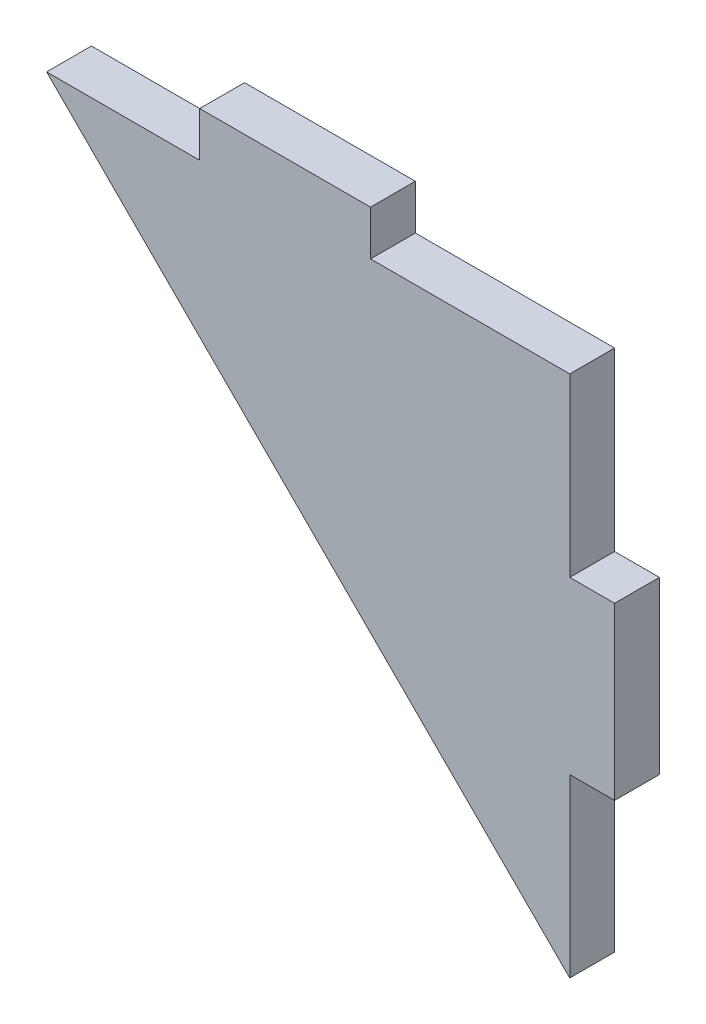
ISO-10303-21;
HEADER;
FILE_DESCRIPTION(('STEP AP214'),'2;1');
FILE_NAME('part.step','',(''),(''),'','','');
FILE_SCHEMA(('AUTOMOTIVE_DESIGN { 1 0 10303 214 1 1 1 1 }'));
ENDSEC;
DATA;
#1=APPLICATION_CONTEXT('core data for automotive mechanical design processes');
#2=APPLICATION_PROTOCOL_DEFINITION('international standard','automotive_design',2000,#1);
#3=PRODUCT_CONTEXT('',#1,'mechanical');
#4=PRODUCT('Part','Part','',(#3));
#5=PRODUCT_RELATED_PRODUCT_CATEGORY('part','',(#4));
#6=PRODUCT_DEFINITION_FORMATION('','',#4);
#7=PRODUCT_DEFINITION_CONTEXT('part definition',#1,'design');
#8=PRODUCT_DEFINITION('design','',#6,#7);
#9=PRODUCT_DEFINITION_SHAPE('','',#8);
#10=(LENGTH_UNIT() NAMED_UNIT(*) SI_UNIT(.MILLI.,.METRE.));
#11=(NAMED_UNIT(*) PLANE_ANGLE_UNIT() SI_UNIT($,.RADIAN.));
#12=(NAMED_UNIT(*) SI_UNIT($,.STERADIAN.) SOLID_ANGLE_UNIT());
#13=UNCERTAINTY_MEASURE_WITH_UNIT(LENGTH_MEASURE(1.E-05),#10,'distance_accuracy_value','');
#14=(GEOMETRIC_REPRESENTATION_CONTEXT(3) GLOBAL_UNCERTAINTY_ASSIGNED_CONTEXT((#13)) GLOBAL_UNIT_ASSIGNED_CONTEXT((#10,
#11,#12)) REPRESENTATION_CONTEXT('',''));
#15=CARTESIAN_POINT('',(0.,0.,0.));
#16=DIRECTION('',(0.,0.,1.));
#17=DIRECTION('',(1.,0.,0.));
#18=AXIS2_PLACEMENT_3D('',#15,#16,#17);
#19=CARTESIAN_POINT('',(0.,0.,0.));
#20=DIRECTION('',(0.,0.,1.));
#21=DIRECTION('',(1.,0.,0.));
#22=AXIS2_PLACEMENT_3D('',#19,#20,#21);
#23=PLANE('',#22);
#24=DIRECTION('',(-1.,0.,0.));
#25=VECTOR('',#24,1.);
#26=CARTESIAN_POINT('',(2.69625591694681E-13,215.9,0.));
#27=LINE('',#26,#25);
#28=CARTESIAN_POINT('',(53.975,215.9,0.));
#29=VERTEX_POINT('',#28);
#30=CARTESIAN_POINT('',(76.2,215.9,0.));
#31=VERTEX_POINT('',#30);
#32=EDGE_CURVE('E142',#29,#31,#27,.F.);
#33=ORIENTED_EDGE('',*,*,#32,.F.);
#34=DIRECTION('',(0.,1.,0.));
#35=VECTOR('',#34,1.);
#36=CARTESIAN_POINT('',(53.975,0.,0.));
#37=LINE('',#36,#35);
#38=CARTESIAN_POINT('',(53.975,220.9,0.));
#39=VERTEX_POINT('',#38);
#40=EDGE_CURVE('E146',#39,#29,#37,.F.);
#41=ORIENTED_EDGE('',*,*,#40,.F.);
#42=DIRECTION('',(1.,0.,0.));
#43=VECTOR('',#42,1.);
#44=CARTESIAN_POINT('',(34.925,220.9,0.));
#45=LINE('',#44,#43);
#46=CARTESIAN_POINT('',(34.925,220.9,0.));
#47=VERTEX_POINT('',#46);
#48=EDGE_CURVE('E153',#39,#47,#45,.F.);
#49=ORIENTED_EDGE('',*,*,#48,.T.);
#50=DIRECTION('',(0.,1.,0.));
#51=VECTOR('',#50,1.);
#52=CARTESIAN_POINT('',(34.925,0.,0.));
#53=LINE('',#52,#51);
#54=CARTESIAN_POINT('',(34.925,215.9,0.));
#55=VERTEX_POINT('',#54);
#56=EDGE_CURVE('E105',#47,#55,#53,.F.);
#57=ORIENTED_EDGE('',*,*,#56,.T.);
#58=DIRECTION('',(1.,0.,0.));
#59=VECTOR('',#58,1.);
#60=CARTESIAN_POINT('',(0.,215.9,0.));
#61=LINE('',#60,#59);
#62=CARTESIAN_POINT('',(17.8437431325959,215.9,0.));
#63=VERTEX_POINT('',#62);
#64=EDGE_CURVE('E19',#63,#55,#61,.T.);
#65=ORIENTED_EDGE('',*,*,#64,.F.);
#66=DIRECTION('',(-0.707106781186551,0.707106781186544,0.));
#67=VECTOR('',#66,1.);
#68=CARTESIAN_POINT('',(116.871871566298,116.871871566299,0.));
#69=LINE('',#68,#67);
#70=CARTESIAN_POINT('',(76.2000000000001,157.543743132596,0.));
#71=VERTEX_POINT('',#70);
#72=EDGE_CURVE('E103',#63,#71,#69,.F.);
#73=ORIENTED_EDGE('',*,*,#72,.T.);
#74=DIRECTION('',(0.,1.,0.));
#75=VECTOR('',#74,1.);
#76=CARTESIAN_POINT('',(76.2,0.,0.));
#77=LINE('',#76,#75);
#78=CARTESIAN_POINT('',(76.2,177.195,0.));
#79=VERTEX_POINT('',#78);
#80=EDGE_CURVE('E96',#79,#71,#77,.F.);
#81=ORIENTED_EDGE('',*,*,#80,.F.);
#82=DIRECTION('',(-1.,0.,0.));
#83=VECTOR('',#82,1.);
#84=CARTESIAN_POINT('',(81.2,177.195,0.));
#85=LINE('',#84,#83);
#86=CARTESIAN_POINT('',(81.2,177.195,0.));
#87=VERTEX_POINT('',#86);
#88=EDGE_CURVE('E123',#79,#87,#85,.F.);
#89=ORIENTED_EDGE('',*,*,#88,.T.);
#90=DIRECTION('',(0.,-1.,0.));
#91=VECTOR('',#90,1.);
#92=CARTESIAN_POINT('',(81.2000000000001,0.,0.));
#93=LINE('',#92,#91);
#94=CARTESIAN_POINT('',(81.2,196.245,0.));
#95=VERTEX_POINT('',#94);
#96=EDGE_CURVE('E130',#87,#95,#93,.F.);
#97=ORIENTED_EDGE('',*,*,#96,.T.);
#98=DIRECTION('',(1.,0.,0.));
#99=VECTOR('',#98,1.);
#100=CARTESIAN_POINT('',(81.2,196.245,0.));
#101=LINE('',#100,#99);
#102=CARTESIAN_POINT('',(76.2,196.245,0.));
#103=VERTEX_POINT('',#102);
#104=EDGE_CURVE('E135',#95,#103,#101,.F.);
#105=ORIENTED_EDGE('',*,*,#104,.T.);
#106=DIRECTION('',(0.,1.,0.));
#107=VECTOR('',#106,1.);
#108=CARTESIAN_POINT('',(76.2,0.,0.));
#109=LINE('',#108,#107);
#110=EDGE_CURVE('E139',#31,#103,#109,.F.);
#111=ORIENTED_EDGE('',*,*,#110,.F.);
#112=EDGE_LOOP('',(#33,#41,#49,#57,#65,#73,#81,#89,#97,#105,#111));
#113=FACE_BOUND('',#112,.T.);
#114=ADVANCED_FACE('F16',(#113),#23,.T.);
#115=CARTESIAN_POINT('',(0.,215.9,-5.));
#116=DIRECTION('',(0.,1.,0.));
#117=DIRECTION('',(0.,0.,1.));
#118=AXIS2_PLACEMENT_3D('',#115,#116,#117);
#119=PLANE('',#118);
#120=DIRECTION('',(0.,0.,-1.));
#121=VECTOR('',#120,1.);
#122=CARTESIAN_POINT('',(34.925,215.9,-5.));
#123=LINE('',#122,#121);
#124=CARTESIAN_POINT('',(34.925,215.9,-5.));
#125=VERTEX_POINT('',#124);
#126=EDGE_CURVE('E155',#55,#125,#123,.T.);
#127=ORIENTED_EDGE('',*,*,#126,.T.);
#128=DIRECTION('',(1.,0.,0.));
#129=VECTOR('',#128,1.);
#130=CARTESIAN_POINT('',(0.,215.9,-5.));
#131=LINE('',#130,#129);
#132=CARTESIAN_POINT('',(17.8437431325959,215.9,-5.));
#133=VERTEX_POINT('',#132);
#134=EDGE_CURVE('E119',#125,#133,#131,.F.);
#135=ORIENTED_EDGE('',*,*,#134,.T.);
#136=DIRECTION('',(0.,0.,1.));
#137=VECTOR('',#136,1.);
#138=CARTESIAN_POINT('',(17.8437431325959,215.9,0.));
#139=LINE('',#138,#137);
#140=EDGE_CURVE('E110',#133,#63,#139,.T.);
#141=ORIENTED_EDGE('',*,*,#140,.T.);
#142=ORIENTED_EDGE('',*,*,#64,.T.);
#143=EDGE_LOOP('',(#127,#135,#141,#142));
#144=FACE_BOUND('',#143,.T.);
#145=ADVANCED_FACE('F118',(#144),#119,.T.);
#146=CARTESIAN_POINT('',(116.871871566298,116.871871566299,0.));
#147=DIRECTION('',(0.707106781186544,0.707106781186551,0.));
#148=DIRECTION('',(-0.707106781186551,0.707106781186544,0.));
#149=AXIS2_PLACEMENT_3D('',#146,#147,#148);
#150=PLANE('',#149);
#151=DIRECTION('',(0.,0.,1.));
#152=VECTOR('',#151,1.);
#153=CARTESIAN_POINT('',(76.2,157.543743132596,-5.));
#154=LINE('',#153,#152);
#155=CARTESIAN_POINT('',(76.2000000000001,157.543743132596,-5.));
#156=VERTEX_POINT('',#155);
#157=EDGE_CURVE('E115',#71,#156,#154,.F.);
#158=ORIENTED_EDGE('',*,*,#157,.F.);
#159=ORIENTED_EDGE('',*,*,#72,.F.);
#160=ORIENTED_EDGE('',*,*,#140,.F.);
#161=DIRECTION('',(0.707106781186547,-0.707106781186549,0.));
#162=VECTOR('',#161,1.);
#163=CARTESIAN_POINT('',(17.843743132596,215.9,-5.));
#164=LINE('',#163,#162);
#165=EDGE_CURVE('E160',#133,#156,#164,.T.);
#166=ORIENTED_EDGE('',*,*,#165,.T.);
#167=EDGE_LOOP('',(#158,#159,#160,#166));
#168=FACE_BOUND('',#167,.T.);
#169=ADVANCED_FACE('F112',(#168),#150,.F.);
#170=CARTESIAN_POINT('',(76.2,0.,-5.));
#171=DIRECTION('',(1.,0.,0.));
#172=DIRECTION('',(0.,1.,0.));
#173=AXIS2_PLACEMENT_3D('',#170,#171,#172);
#174=PLANE('',#173);
#175=ORIENTED_EDGE('',*,*,#157,.T.);
#176=DIRECTION('',(0.,1.,0.));
#177=VECTOR('',#176,1.);
#178=CARTESIAN_POINT('',(76.2,0.,-5.));
#179=LINE('',#178,#177);
#180=CARTESIAN_POINT('',(76.2,177.195,-5.));
#181=VERTEX_POINT('',#180);
#182=EDGE_CURVE('E162',#156,#181,#179,.T.);
#183=ORIENTED_EDGE('',*,*,#182,.T.);
#184=DIRECTION('',(0.,0.,1.));
#185=VECTOR('',#184,1.);
#186=CARTESIAN_POINT('',(76.2,177.195,0.));
#187=LINE('',#186,#185);
#188=EDGE_CURVE('E125',#181,#79,#187,.T.);
#189=ORIENTED_EDGE('',*,*,#188,.T.);
#190=ORIENTED_EDGE('',*,*,#80,.T.);
#191=EDGE_LOOP('',(#175,#183,#189,#190));
#192=FACE_BOUND('',#191,.T.);
#193=ADVANCED_FACE('F215',(#192),#174,.T.);
#194=CARTESIAN_POINT('',(81.2,177.195,0.));
#195=DIRECTION('',(0.,1.,0.));
#196=DIRECTION('',(-1.,0.,0.));
#197=AXIS2_PLACEMENT_3D('',#194,#195,#196);
#198=PLANE('',#197);
#199=DIRECTION('',(1.,0.,0.));
#200=VECTOR('',#199,1.);
#201=CARTESIAN_POINT('',(0.,177.195,-5.));
#202=LINE('',#201,#200);
#203=CARTESIAN_POINT('',(81.2,177.195,-5.));
#204=VERTEX_POINT('',#203);
#205=EDGE_CURVE('E165',#181,#204,#202,.T.);
#206=ORIENTED_EDGE('',*,*,#205,.T.);
#207=DIRECTION('',(0.,0.,1.));
#208=VECTOR('',#207,1.);
#209=CARTESIAN_POINT('',(81.2,177.195,0.));
#210=LINE('',#209,#208);
#211=EDGE_CURVE('E127',#204,#87,#210,.T.);
#212=ORIENTED_EDGE('',*,*,#211,.T.);
#213=ORIENTED_EDGE('',*,*,#88,.F.);
#214=ORIENTED_EDGE('',*,*,#188,.F.);
#215=EDGE_LOOP('',(#206,#212,#213,#214));
#216=FACE_BOUND('',#215,.T.);
#217=ADVANCED_FACE('F213',(#216),#198,.F.);
#218=CARTESIAN_POINT('',(81.2000000000001,0.,0.));
#219=DIRECTION('',(-1.,0.,0.));
#220=DIRECTION('',(0.,-1.,0.));
#221=AXIS2_PLACEMENT_3D('',#218,#219,#220);
#222=PLANE('',#221);
#223=DIRECTION('',(0.,0.,1.));
#224=VECTOR('',#223,1.);
#225=CARTESIAN_POINT('',(81.2,196.245,0.));
#226=LINE('',#225,#224);
#227=CARTESIAN_POINT('',(81.2,196.245,-5.));
#228=VERTEX_POINT('',#227);
#229=EDGE_CURVE('E132',#228,#95,#226,.T.);
#230=ORIENTED_EDGE('',*,*,#229,.T.);
#231=ORIENTED_EDGE('',*,*,#96,.F.);
#232=ORIENTED_EDGE('',*,*,#211,.F.);
#233=DIRECTION('',(0.,1.,0.));
#234=VECTOR('',#233,1.);
#235=CARTESIAN_POINT('',(81.2,0.,-5.));
#236=LINE('',#235,#234);
#237=EDGE_CURVE('E168',#204,#228,#236,.T.);
#238=ORIENTED_EDGE('',*,*,#237,.T.);
#239=EDGE_LOOP('',(#230,#231,#232,#238));
#240=FACE_BOUND('',#239,.T.);
#241=ADVANCED_FACE('F210',(#240),#222,.F.);
#242=CARTESIAN_POINT('',(81.2,196.245,0.));
#243=DIRECTION('',(0.,-1.,0.));
#244=DIRECTION('',(1.,0.,0.));
#245=AXIS2_PLACEMENT_3D('',#242,#243,#244);
#246=PLANE('',#245);
#247=ORIENTED_EDGE('',*,*,#104,.F.);
#248=ORIENTED_EDGE('',*,*,#229,.F.);
#249=DIRECTION('',(1.,0.,0.));
#250=VECTOR('',#249,1.);
#251=CARTESIAN_POINT('',(0.,196.245,-5.));
#252=LINE('',#251,#250);
#253=CARTESIAN_POINT('',(76.2,196.245,-5.));
#254=VERTEX_POINT('',#253);
#255=EDGE_CURVE('E171',#228,#254,#252,.F.);
#256=ORIENTED_EDGE('',*,*,#255,.T.);
#257=DIRECTION('',(0.,0.,1.));
#258=VECTOR('',#257,1.);
#259=CARTESIAN_POINT('',(76.2,196.245,-5.));
#260=LINE('',#259,#258);
#261=EDGE_CURVE('E137',#103,#254,#260,.F.);
#262=ORIENTED_EDGE('',*,*,#261,.F.);
#263=EDGE_LOOP('',(#247,#248,#256,#262));
#264=FACE_BOUND('',#263,.T.);
#265=ADVANCED_FACE('F206',(#264),#246,.F.);
#266=CARTESIAN_POINT('',(76.2,0.,-5.));
#267=DIRECTION('',(1.,0.,0.));
#268=DIRECTION('',(0.,1.,0.));
#269=AXIS2_PLACEMENT_3D('',#266,#267,#268);
#270=PLANE('',#269);
#271=DIRECTION('',(0.,0.,1.));
#272=VECTOR('',#271,1.);
#273=CARTESIAN_POINT('',(76.2,215.9,-5.));
#274=LINE('',#273,#272);
#275=CARTESIAN_POINT('',(76.2,215.9,-5.));
#276=VERTEX_POINT('',#275);
#277=EDGE_CURVE('E144',#31,#276,#274,.F.);
#278=ORIENTED_EDGE('',*,*,#277,.F.);
#279=ORIENTED_EDGE('',*,*,#110,.T.);
#280=ORIENTED_EDGE('',*,*,#261,.T.);
#281=DIRECTION('',(0.,1.,0.));
#282=VECTOR('',#281,1.);
#283=CARTESIAN_POINT('',(76.2,0.,-5.));
#284=LINE('',#283,#282);
#285=EDGE_CURVE('E174',#254,#276,#284,.T.);
#286=ORIENTED_EDGE('',*,*,#285,.T.);
#287=EDGE_LOOP('',(#278,#279,#280,#286));
#288=FACE_BOUND('',#287,.T.);
#289=ADVANCED_FACE('F202',(#288),#270,.T.);
#290=CARTESIAN_POINT('',(2.69625591694681E-13,215.9,-5.));
#291=DIRECTION('',(0.,1.,0.));
#292=DIRECTION('',(-1.,0.,0.));
#293=AXIS2_PLACEMENT_3D('',#290,#291,#292);
#294=PLANE('',#293);
#295=DIRECTION('',(1.,0.,0.));
#296=VECTOR('',#295,1.);
#297=CARTESIAN_POINT('',(0.,215.9,-5.));
#298=LINE('',#297,#296);
#299=CARTESIAN_POINT('',(53.975,215.9,-5.));
#300=VERTEX_POINT('',#299);
#301=EDGE_CURVE('E177',#276,#300,#298,.F.);
#302=ORIENTED_EDGE('',*,*,#301,.T.);
#303=DIRECTION('',(0.,0.,-1.));
#304=VECTOR('',#303,1.);
#305=CARTESIAN_POINT('',(53.975,215.9,-5.));
#306=LINE('',#305,#304);
#307=EDGE_CURVE('E148',#29,#300,#306,.T.);
#308=ORIENTED_EDGE('',*,*,#307,.F.);
#309=ORIENTED_EDGE('',*,*,#32,.T.);
#310=ORIENTED_EDGE('',*,*,#277,.T.);
#311=EDGE_LOOP('',(#302,#308,#309,#310));
#312=FACE_BOUND('',#311,.T.);
#313=ADVANCED_FACE('F196',(#312),#294,.T.);
#314=CARTESIAN_POINT('',(53.975,0.,-5.));
#315=DIRECTION('',(1.,0.,0.));
#316=DIRECTION('',(0.,0.,-1.));
#317=AXIS2_PLACEMENT_3D('',#314,#315,#316);
#318=PLANE('',#317);
#319=ORIENTED_EDGE('',*,*,#307,.T.);
#320=DIRECTION('',(0.,1.,0.));
#321=VECTOR('',#320,1.);
#322=CARTESIAN_POINT('',(53.975,0.,-5.));
#323=LINE('',#322,#321);
#324=CARTESIAN_POINT('',(53.975,220.9,-5.));
#325=VERTEX_POINT('',#324);
#326=EDGE_CURVE('E180',#300,#325,#323,.T.);
#327=ORIENTED_EDGE('',*,*,#326,.T.);
#328=DIRECTION('',(0.,0.,-1.));
#329=VECTOR('',#328,1.);
#330=CARTESIAN_POINT('',(53.975,220.9,-5.));
#331=LINE('',#330,#329);
#332=EDGE_CURVE('E150',#325,#39,#331,.F.);
#333=ORIENTED_EDGE('',*,*,#332,.T.);
#334=ORIENTED_EDGE('',*,*,#40,.T.);
#335=EDGE_LOOP('',(#319,#327,#333,#334));
#336=FACE_BOUND('',#335,.T.);
#337=ADVANCED_FACE('F193',(#336),#318,.T.);
#338=CARTESIAN_POINT('',(34.925,220.9,-5.));
#339=DIRECTION('',(0.,-1.,0.));
#340=DIRECTION('',(0.,0.,-1.));
#341=AXIS2_PLACEMENT_3D('',#338,#339,#340);
#342=PLANE('',#341);
#343=ORIENTED_EDGE('',*,*,#332,.F.);
#344=DIRECTION('',(1.,0.,0.));
#345=VECTOR('',#344,1.);
#346=CARTESIAN_POINT('',(0.,220.9,-5.));
#347=LINE('',#346,#345);
#348=CARTESIAN_POINT('',(34.925,220.9,-5.));
#349=VERTEX_POINT('',#348);
#350=EDGE_CURVE('E25',#325,#349,#347,.F.);
#351=ORIENTED_EDGE('',*,*,#350,.T.);
#352=DIRECTION('',(0.,0.,-1.));
#353=VECTOR('',#352,1.);
#354=CARTESIAN_POINT('',(34.925,220.9,-5.));
#355=LINE('',#354,#353);
#356=EDGE_CURVE('E33',#349,#47,#355,.F.);
#357=ORIENTED_EDGE('',*,*,#356,.T.);
#358=ORIENTED_EDGE('',*,*,#48,.F.);
#359=EDGE_LOOP('',(#343,#351,#357,#358));
#360=FACE_BOUND('',#359,.T.);
#361=ADVANCED_FACE('F186',(#360),#342,.F.);
#362=CARTESIAN_POINT('',(34.925,0.,-5.));
#363=DIRECTION('',(1.,0.,0.));
#364=DIRECTION('',(0.,0.,-1.));
#365=AXIS2_PLACEMENT_3D('',#362,#363,#364);
#366=PLANE('',#365);
#367=ORIENTED_EDGE('',*,*,#356,.F.);
#368=DIRECTION('',(0.,1.,0.));
#369=VECTOR('',#368,1.);
#370=CARTESIAN_POINT('',(34.925,0.,-5.));
#371=LINE('',#370,#369);
#372=EDGE_CURVE('E11',#349,#125,#371,.F.);
#373=ORIENTED_EDGE('',*,*,#372,.T.);
#374=ORIENTED_EDGE('',*,*,#126,.F.);
#375=ORIENTED_EDGE('',*,*,#56,.F.);
#376=EDGE_LOOP('',(#367,#373,#374,#375));
#377=FACE_BOUND('',#376,.T.);
#378=ADVANCED_FACE('F227',(#377),#366,.F.);
#379=CARTESIAN_POINT('',(0.,0.,-5.));
#380=DIRECTION('',(0.,0.,1.));
#381=DIRECTION('',(1.,0.,0.));
#382=AXIS2_PLACEMENT_3D('',#379,#380,#381);
#383=PLANE('',#382);
#384=ORIENTED_EDGE('',*,*,#350,.F.);
#385=ORIENTED_EDGE('',*,*,#326,.F.);
#386=ORIENTED_EDGE('',*,*,#301,.F.);
#387=ORIENTED_EDGE('',*,*,#285,.F.);
#388=ORIENTED_EDGE('',*,*,#255,.F.);
#389=ORIENTED_EDGE('',*,*,#237,.F.);
#390=ORIENTED_EDGE('',*,*,#205,.F.);
#391=ORIENTED_EDGE('',*,*,#182,.F.);
#392=ORIENTED_EDGE('',*,*,#165,.F.);
#393=ORIENTED_EDGE('',*,*,#134,.F.);
#394=ORIENTED_EDGE('',*,*,#372,.F.);
#395=EDGE_LOOP('',(#384,#385,#386,#387,#388,#389,#390,#391,#392,#393,#394));
#396=FACE_BOUND('',#395,.T.);
#397=ADVANCED_FACE('F190',(#396),#383,.F.);
#398=CLOSED_SHELL('',(#114,#145,#169,#193,#217,#241,#265,#289,#313,#337,#361,#378,#397));
#399=MANIFOLD_SOLID_BREP('B1',#398);
#400=ADVANCED_BREP_SHAPE_REPRESENTATION('',(#18,#399),#14);
#401=SHAPE_DEFINITION_REPRESENTATION(#9,#400);
ENDSEC;
END-ISO-10303-21;
